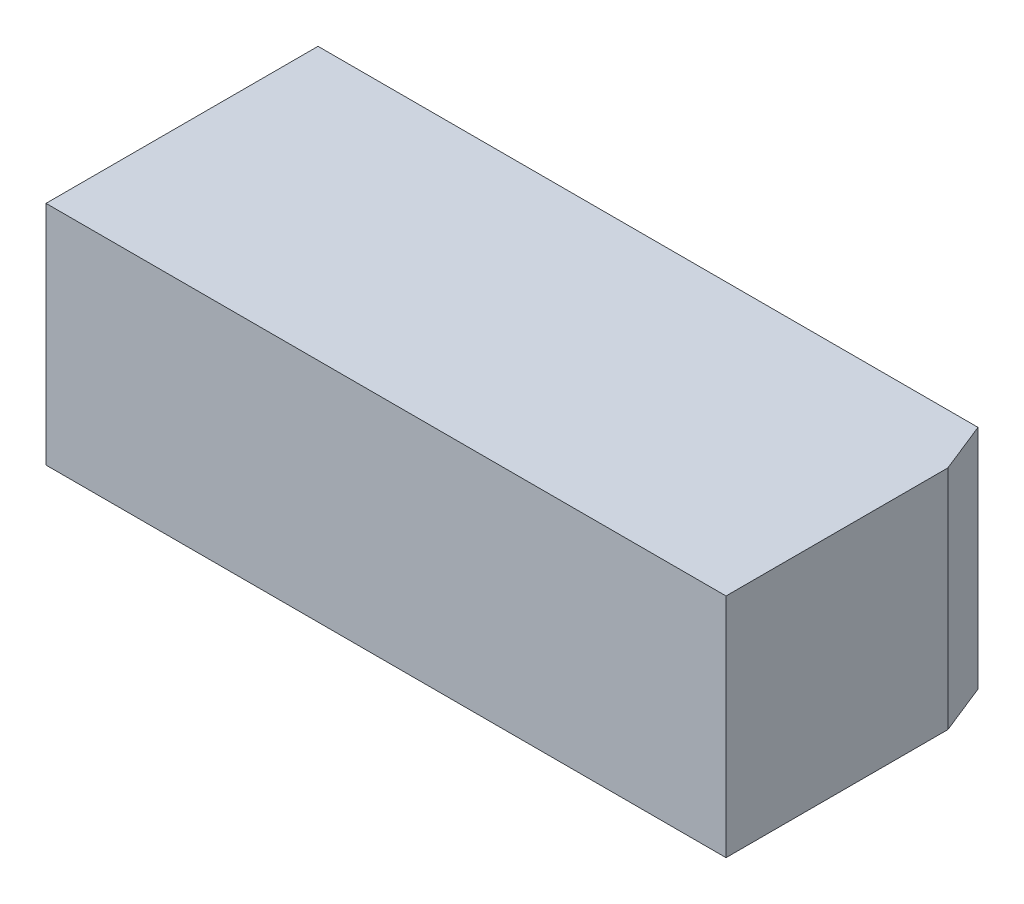
ISO-10303-21;
HEADER;
FILE_DESCRIPTION(('STEP AP214'),'2;1');
FILE_NAME('part.step','',(''),(''),'','','');
FILE_SCHEMA(('AUTOMOTIVE_DESIGN { 1 0 10303 214 1 1 1 1 }'));
ENDSEC;
DATA;
#1=APPLICATION_CONTEXT('core data for automotive mechanical design processes');
#2=APPLICATION_PROTOCOL_DEFINITION('international standard','automotive_design',2000,#1);
#3=PRODUCT_CONTEXT('',#1,'mechanical');
#4=PRODUCT('Part','Part','',(#3));
#5=PRODUCT_RELATED_PRODUCT_CATEGORY('part','',(#4));
#6=PRODUCT_DEFINITION_FORMATION('','',#4);
#7=PRODUCT_DEFINITION_CONTEXT('part definition',#1,'design');
#8=PRODUCT_DEFINITION('design','',#6,#7);
#9=PRODUCT_DEFINITION_SHAPE('','',#8);
#10=(LENGTH_UNIT() NAMED_UNIT(*) SI_UNIT(.MILLI.,.METRE.));
#11=(NAMED_UNIT(*) PLANE_ANGLE_UNIT() SI_UNIT($,.RADIAN.));
#12=(NAMED_UNIT(*) SI_UNIT($,.STERADIAN.) SOLID_ANGLE_UNIT());
#13=UNCERTAINTY_MEASURE_WITH_UNIT(LENGTH_MEASURE(1.E-05),#10,'distance_accuracy_value','');
#14=(GEOMETRIC_REPRESENTATION_CONTEXT(3) GLOBAL_UNCERTAINTY_ASSIGNED_CONTEXT((#13)) GLOBAL_UNIT_ASSIGNED_CONTEXT((#10,
#11,#12)) REPRESENTATION_CONTEXT('',''));
#15=CARTESIAN_POINT('',(0.,0.,0.));
#16=DIRECTION('',(0.,0.,1.));
#17=DIRECTION('',(1.,0.,0.));
#18=AXIS2_PLACEMENT_3D('',#15,#16,#17);
#19=CARTESIAN_POINT('',(-7.5,5.,-3.));
#20=DIRECTION('',(1.,0.,0.));
#21=DIRECTION('',(0.,0.,-1.));
#22=AXIS2_PLACEMENT_3D('',#19,#20,#21);
#23=PLANE('',#22);
#24=DIRECTION('',(0.,0.,1.));
#25=VECTOR('',#24,1.);
#26=CARTESIAN_POINT('',(-7.5,0.,-3.));
#27=LINE('',#26,#25);
#28=CARTESIAN_POINT('',(-7.5,0.,-3.));
#29=VERTEX_POINT('',#28);
#30=CARTESIAN_POINT('',(-7.5,0.,3.));
#31=VERTEX_POINT('',#30);
#32=EDGE_CURVE('E109',#29,#31,#27,.T.);
#33=ORIENTED_EDGE('',*,*,#32,.T.);
#34=DIRECTION('',(0.,-1.,0.));
#35=VECTOR('',#34,1.);
#36=CARTESIAN_POINT('',(-7.5,5.,3.));
#37=LINE('',#36,#35);
#38=CARTESIAN_POINT('',(-7.5,5.,3.));
#39=VERTEX_POINT('',#38);
#40=EDGE_CURVE('E11',#39,#31,#37,.T.);
#41=ORIENTED_EDGE('',*,*,#40,.F.);
#42=DIRECTION('',(0.,0.,1.));
#43=VECTOR('',#42,1.);
#44=CARTESIAN_POINT('',(-7.5,5.,-3.));
#45=LINE('',#44,#43);
#46=CARTESIAN_POINT('',(-7.5,5.,-3.));
#47=VERTEX_POINT('',#46);
#48=EDGE_CURVE('E105',#47,#39,#45,.T.);
#49=ORIENTED_EDGE('',*,*,#48,.F.);
#50=DIRECTION('',(0.,-1.,0.));
#51=VECTOR('',#50,1.);
#52=CARTESIAN_POINT('',(-7.5,5.,-3.));
#53=LINE('',#52,#51);
#54=EDGE_CURVE('E103',#47,#29,#53,.T.);
#55=ORIENTED_EDGE('',*,*,#54,.T.);
#56=EDGE_LOOP('',(#33,#41,#49,#55));
#57=FACE_BOUND('',#56,.T.);
#58=ADVANCED_FACE('F33',(#57),#23,.F.);
#59=CARTESIAN_POINT('',(7.5,5.,3.));
#60=DIRECTION('',(0.,0.,-1.));
#61=DIRECTION('',(-1.,0.,0.));
#62=AXIS2_PLACEMENT_3D('',#59,#60,#61);
#63=PLANE('',#62);
#64=DIRECTION('',(1.,0.,0.));
#65=VECTOR('',#64,1.);
#66=CARTESIAN_POINT('',(7.5,0.,3.));
#67=LINE('',#66,#65);
#68=CARTESIAN_POINT('',(7.5,0.,3.));
#69=VERTEX_POINT('',#68);
#70=EDGE_CURVE('E112',#31,#69,#67,.T.);
#71=ORIENTED_EDGE('',*,*,#70,.T.);
#72=DIRECTION('',(0.,-1.,0.));
#73=VECTOR('',#72,1.);
#74=CARTESIAN_POINT('',(7.5,5.,3.));
#75=LINE('',#74,#73);
#76=CARTESIAN_POINT('',(7.5,5.,3.));
#77=VERTEX_POINT('',#76);
#78=EDGE_CURVE('E40',#77,#69,#75,.T.);
#79=ORIENTED_EDGE('',*,*,#78,.F.);
#80=DIRECTION('',(1.,0.,0.));
#81=VECTOR('',#80,1.);
#82=CARTESIAN_POINT('',(7.5,5.,3.));
#83=LINE('',#82,#81);
#84=EDGE_CURVE('E79',#39,#77,#83,.T.);
#85=ORIENTED_EDGE('',*,*,#84,.F.);
#86=ORIENTED_EDGE('',*,*,#40,.T.);
#87=EDGE_LOOP('',(#71,#79,#85,#86));
#88=FACE_BOUND('',#87,.T.);
#89=ADVANCED_FACE('F154',(#88),#63,.F.);
#90=CARTESIAN_POINT('',(7.5,5.,-3.));
#91=DIRECTION('',(-1.,0.,0.));
#92=DIRECTION('',(0.,0.,1.));
#93=AXIS2_PLACEMENT_3D('',#90,#91,#92);
#94=PLANE('',#93);
#95=DIRECTION('',(0.,0.,-1.));
#96=VECTOR('',#95,1.);
#97=CARTESIAN_POINT('',(7.5,0.,-3.));
#98=LINE('',#97,#96);
#99=CARTESIAN_POINT('',(7.5,0.,-1.89511273784654));
#100=VERTEX_POINT('',#99);
#101=EDGE_CURVE('E99',#69,#100,#98,.T.);
#102=ORIENTED_EDGE('',*,*,#101,.T.);
#103=DIRECTION('',(0.,-1.,0.));
#104=VECTOR('',#103,1.);
#105=CARTESIAN_POINT('',(7.5,5.,-1.89511273784654));
#106=LINE('',#105,#104);
#107=CARTESIAN_POINT('',(7.5,5.,-1.89511273784654));
#108=VERTEX_POINT('',#107);
#109=EDGE_CURVE('E47',#108,#100,#106,.T.);
#110=ORIENTED_EDGE('',*,*,#109,.F.);
#111=DIRECTION('',(0.,0.,-1.));
#112=VECTOR('',#111,1.);
#113=CARTESIAN_POINT('',(7.5,5.,-3.));
#114=LINE('',#113,#112);
#115=EDGE_CURVE('E97',#77,#108,#114,.T.);
#116=ORIENTED_EDGE('',*,*,#115,.F.);
#117=ORIENTED_EDGE('',*,*,#78,.T.);
#118=EDGE_LOOP('',(#102,#110,#116,#117));
#119=FACE_BOUND('',#118,.T.);
#120=ADVANCED_FACE('F95',(#119),#94,.F.);
#121=CARTESIAN_POINT('',(7.5,5.,-3.));
#122=DIRECTION('',(0.,0.,1.));
#123=DIRECTION('',(1.,0.,0.));
#124=AXIS2_PLACEMENT_3D('',#121,#122,#123);
#125=PLANE('',#124);
#126=DIRECTION('',(-1.,0.,0.));
#127=VECTOR('',#126,1.);
#128=CARTESIAN_POINT('',(7.5,5.,-3.));
#129=LINE('',#128,#127);
#130=CARTESIAN_POINT('',(7.05804509513862,5.,-3.));
#131=VERTEX_POINT('',#130);
#132=EDGE_CURVE('E56',#131,#47,#129,.T.);
#133=ORIENTED_EDGE('',*,*,#132,.F.);
#134=DIRECTION('',(0.,-1.,0.));
#135=VECTOR('',#134,1.);
#136=CARTESIAN_POINT('',(7.05804509513862,5.,-3.));
#137=LINE('',#136,#135);
#138=CARTESIAN_POINT('',(7.05804509513862,0.,-3.));
#139=VERTEX_POINT('',#138);
#140=EDGE_CURVE('E88',#131,#139,#137,.T.);
#141=ORIENTED_EDGE('',*,*,#140,.T.);
#142=DIRECTION('',(-1.,0.,0.));
#143=VECTOR('',#142,1.);
#144=CARTESIAN_POINT('',(7.5,0.,-3.));
#145=LINE('',#144,#143);
#146=EDGE_CURVE('E74',#139,#29,#145,.T.);
#147=ORIENTED_EDGE('',*,*,#146,.T.);
#148=ORIENTED_EDGE('',*,*,#54,.F.);
#149=EDGE_LOOP('',(#133,#141,#147,#148));
#150=FACE_BOUND('',#149,.T.);
#151=ADVANCED_FACE('F160',(#150),#125,.F.);
#152=CARTESIAN_POINT('',(0.,5.,0.));
#153=DIRECTION('',(0.,-1.,0.));
#154=DIRECTION('',(0.,0.,-1.));
#155=AXIS2_PLACEMENT_3D('',#152,#153,#154);
#156=PLANE('',#155);
#157=ORIENTED_EDGE('',*,*,#115,.T.);
#158=DIRECTION('',(-0.371390676354104,0.,-0.928476690885259));
#159=VECTOR('',#158,1.);
#160=CARTESIAN_POINT('',(7.05804509513862,5.,-3.));
#161=LINE('',#160,#159);
#162=EDGE_CURVE('E86',#108,#131,#161,.T.);
#163=ORIENTED_EDGE('',*,*,#162,.T.);
#164=ORIENTED_EDGE('',*,*,#132,.T.);
#165=ORIENTED_EDGE('',*,*,#48,.T.);
#166=ORIENTED_EDGE('',*,*,#84,.T.);
#167=EDGE_LOOP('',(#157,#163,#164,#165,#166));
#168=FACE_BOUND('',#167,.T.);
#169=ADVANCED_FACE('F101',(#168),#156,.F.);
#170=CARTESIAN_POINT('',(0.,0.,0.));
#171=DIRECTION('',(0.,-1.,0.));
#172=DIRECTION('',(0.,0.,-1.));
#173=AXIS2_PLACEMENT_3D('',#170,#171,#172);
#174=PLANE('',#173);
#175=CARTESIAN_POINT('',(-2.,0.,-2.));
#176=DIRECTION('',(0.,-1.,0.));
#177=DIRECTION('',(0.,0.,-1.));
#178=AXIS2_PLACEMENT_3D('',#175,#176,#177);
#179=CIRCLE('',#178,0.5);
#180=CARTESIAN_POINT('',(-2.,0.,-2.5));
#181=VERTEX_POINT('',#180);
#182=EDGE_CURVE('E124',#181,#181,#179,.T.);
#183=ORIENTED_EDGE('',*,*,#182,.F.);
#184=EDGE_LOOP('',(#183));
#185=FACE_BOUND('',#184,.T.);
#186=DIRECTION('',(-0.371390676354104,0.,-0.928476690885259));
#187=VECTOR('',#186,1.);
#188=CARTESIAN_POINT('',(7.05804509513862,0.,-3.));
#189=LINE('',#188,#187);
#190=EDGE_CURVE('E90',#100,#139,#189,.T.);
#191=ORIENTED_EDGE('',*,*,#190,.F.);
#192=ORIENTED_EDGE('',*,*,#101,.F.);
#193=ORIENTED_EDGE('',*,*,#70,.F.);
#194=ORIENTED_EDGE('',*,*,#32,.F.);
#195=ORIENTED_EDGE('',*,*,#146,.F.);
#196=EDGE_LOOP('',(#191,#192,#193,#194,#195));
#197=FACE_BOUND('',#196,.T.);
#198=CARTESIAN_POINT('',(-1.5,0.,0.));
#199=DIRECTION('',(0.,-1.,0.));
#200=DIRECTION('',(0.,0.,-1.));
#201=AXIS2_PLACEMENT_3D('',#198,#199,#200);
#202=CIRCLE('',#201,0.795000000000002);
#203=CARTESIAN_POINT('',(-1.5,0.,-0.795000000000002));
#204=VERTEX_POINT('',#203);
#205=EDGE_CURVE('E128',#204,#204,#202,.T.);
#206=ORIENTED_EDGE('',*,*,#205,.F.);
#207=EDGE_LOOP('',(#206));
#208=FACE_BOUND('',#207,.T.);
#209=CARTESIAN_POINT('',(-6.25,0.,1.875));
#210=DIRECTION('',(0.,-1.,0.));
#211=DIRECTION('',(0.,0.,-1.));
#212=AXIS2_PLACEMENT_3D('',#209,#210,#211);
#213=CIRCLE('',#212,0.795000000000002);
#214=CARTESIAN_POINT('',(-6.25,0.,1.08));
#215=VERTEX_POINT('',#214);
#216=EDGE_CURVE('E133',#215,#215,#213,.T.);
#217=ORIENTED_EDGE('',*,*,#216,.F.);
#218=EDGE_LOOP('',(#217));
#219=FACE_BOUND('',#218,.T.);
#220=CARTESIAN_POINT('',(-6.25,0.,-1.875));
#221=DIRECTION('',(0.,-1.,0.));
#222=DIRECTION('',(0.,0.,-1.));
#223=AXIS2_PLACEMENT_3D('',#220,#221,#222);
#224=CIRCLE('',#223,0.795000000000001);
#225=CARTESIAN_POINT('',(-6.25,0.,-2.67));
#226=VERTEX_POINT('',#225);
#227=EDGE_CURVE('E139',#226,#226,#224,.T.);
#228=ORIENTED_EDGE('',*,*,#227,.F.);
#229=EDGE_LOOP('',(#228));
#230=FACE_BOUND('',#229,.T.);
#231=CARTESIAN_POINT('',(-4.5,0.,0.));
#232=DIRECTION('',(0.,-1.,0.));
#233=DIRECTION('',(0.,0.,-1.));
#234=AXIS2_PLACEMENT_3D('',#231,#232,#233);
#235=CIRCLE('',#234,1.25);
#236=CARTESIAN_POINT('',(-4.5,0.,-1.25));
#237=VERTEX_POINT('',#236);
#238=EDGE_CURVE('E145',#237,#237,#235,.T.);
#239=ORIENTED_EDGE('',*,*,#238,.F.);
#240=EDGE_LOOP('',(#239));
#241=FACE_BOUND('',#240,.T.);
#242=ADVANCED_FACE('F118',(#185,#197,#208,#219,#230,#241),#174,.T.);
#243=CARTESIAN_POINT('',(-4.5,4.,0.));
#244=DIRECTION('',(0.,-1.,0.));
#245=DIRECTION('',(0.,0.,-1.));
#246=AXIS2_PLACEMENT_3D('',#243,#244,#245);
#247=CYLINDRICAL_SURFACE('',#246,1.25);
#248=CARTESIAN_POINT('',(-4.5,4.,0.));
#249=DIRECTION('',(0.,-1.,0.));
#250=DIRECTION('',(0.,0.,-1.));
#251=AXIS2_PLACEMENT_3D('',#248,#249,#250);
#252=CIRCLE('',#251,1.25);
#253=CARTESIAN_POINT('',(-4.5,4.,-1.25));
#254=VERTEX_POINT('',#253);
#255=EDGE_CURVE('E113',#254,#254,#252,.T.);
#256=ORIENTED_EDGE('',*,*,#255,.F.);
#257=EDGE_LOOP('',(#256));
#258=FACE_BOUND('',#257,.T.);
#259=ORIENTED_EDGE('',*,*,#238,.T.);
#260=EDGE_LOOP('',(#259));
#261=FACE_BOUND('',#260,.T.);
#262=ADVANCED_FACE('F167',(#258,#261),#247,.F.);
#263=CARTESIAN_POINT('',(-4.5,4.,0.));
#264=DIRECTION('',(0.,-1.,0.));
#265=DIRECTION('',(0.,0.,-1.));
#266=AXIS2_PLACEMENT_3D('',#263,#264,#265);
#267=PLANE('',#266);
#268=ORIENTED_EDGE('',*,*,#255,.T.);
#269=EDGE_LOOP('',(#268));
#270=FACE_BOUND('',#269,.T.);
#271=ADVANCED_FACE('F173',(#270),#267,.T.);
#272=CARTESIAN_POINT('',(-6.25,1.,-1.875));
#273=DIRECTION('',(0.,-1.,0.));
#274=DIRECTION('',(0.,0.,-1.));
#275=AXIS2_PLACEMENT_3D('',#272,#273,#274);
#276=CYLINDRICAL_SURFACE('',#275,0.795000000000001);
#277=CARTESIAN_POINT('',(-6.25,1.,-1.875));
#278=DIRECTION('',(0.,-1.,0.));
#279=DIRECTION('',(0.,0.,-1.));
#280=AXIS2_PLACEMENT_3D('',#277,#278,#279);
#281=CIRCLE('',#280,0.795000000000001);
#282=CARTESIAN_POINT('',(-6.25,1.,-2.67));
#283=VERTEX_POINT('',#282);
#284=EDGE_CURVE('E142',#283,#283,#281,.T.);
#285=ORIENTED_EDGE('',*,*,#284,.F.);
#286=EDGE_LOOP('',(#285));
#287=FACE_BOUND('',#286,.T.);
#288=ORIENTED_EDGE('',*,*,#227,.T.);
#289=EDGE_LOOP('',(#288));
#290=FACE_BOUND('',#289,.T.);
#291=ADVANCED_FACE('F177',(#287,#290),#276,.F.);
#292=CARTESIAN_POINT('',(-6.25,1.,-1.875));
#293=DIRECTION('',(0.,-1.,0.));
#294=DIRECTION('',(0.,0.,-1.));
#295=AXIS2_PLACEMENT_3D('',#292,#293,#294);
#296=PLANE('',#295);
#297=ORIENTED_EDGE('',*,*,#284,.T.);
#298=EDGE_LOOP('',(#297));
#299=FACE_BOUND('',#298,.T.);
#300=ADVANCED_FACE('F181',(#299),#296,.T.);
#301=CARTESIAN_POINT('',(-6.25,1.,1.875));
#302=DIRECTION('',(0.,-1.,0.));
#303=DIRECTION('',(0.,0.,-1.));
#304=AXIS2_PLACEMENT_3D('',#301,#302,#303);
#305=CYLINDRICAL_SURFACE('',#304,0.795000000000002);
#306=CARTESIAN_POINT('',(-6.25,1.,1.875));
#307=DIRECTION('',(0.,-1.,0.));
#308=DIRECTION('',(0.,0.,-1.));
#309=AXIS2_PLACEMENT_3D('',#306,#307,#308);
#310=CIRCLE('',#309,0.795000000000002);
#311=CARTESIAN_POINT('',(-6.25,1.,1.08));
#312=VERTEX_POINT('',#311);
#313=EDGE_CURVE('E136',#312,#312,#310,.T.);
#314=ORIENTED_EDGE('',*,*,#313,.F.);
#315=EDGE_LOOP('',(#314));
#316=FACE_BOUND('',#315,.T.);
#317=ORIENTED_EDGE('',*,*,#216,.T.);
#318=EDGE_LOOP('',(#317));
#319=FACE_BOUND('',#318,.T.);
#320=ADVANCED_FACE('F185',(#316,#319),#305,.F.);
#321=CARTESIAN_POINT('',(-6.25,1.,1.875));
#322=DIRECTION('',(0.,-1.,0.));
#323=DIRECTION('',(0.,0.,-1.));
#324=AXIS2_PLACEMENT_3D('',#321,#322,#323);
#325=PLANE('',#324);
#326=ORIENTED_EDGE('',*,*,#313,.T.);
#327=EDGE_LOOP('',(#326));
#328=FACE_BOUND('',#327,.T.);
#329=ADVANCED_FACE('F189',(#328),#325,.T.);
#330=CARTESIAN_POINT('',(-1.5,1.,0.));
#331=DIRECTION('',(0.,-1.,0.));
#332=DIRECTION('',(0.,0.,-1.));
#333=AXIS2_PLACEMENT_3D('',#330,#331,#332);
#334=CYLINDRICAL_SURFACE('',#333,0.795000000000002);
#335=CARTESIAN_POINT('',(-1.5,1.,0.));
#336=DIRECTION('',(0.,-1.,0.));
#337=DIRECTION('',(0.,0.,-1.));
#338=AXIS2_PLACEMENT_3D('',#335,#336,#337);
#339=CIRCLE('',#338,0.795000000000002);
#340=CARTESIAN_POINT('',(-1.5,1.,-0.795000000000002));
#341=VERTEX_POINT('',#340);
#342=EDGE_CURVE('E130',#341,#341,#339,.T.);
#343=ORIENTED_EDGE('',*,*,#342,.F.);
#344=EDGE_LOOP('',(#343));
#345=FACE_BOUND('',#344,.T.);
#346=ORIENTED_EDGE('',*,*,#205,.T.);
#347=EDGE_LOOP('',(#346));
#348=FACE_BOUND('',#347,.T.);
#349=ADVANCED_FACE('F193',(#345,#348),#334,.F.);
#350=CARTESIAN_POINT('',(-1.5,1.,0.));
#351=DIRECTION('',(0.,-1.,0.));
#352=DIRECTION('',(0.,0.,-1.));
#353=AXIS2_PLACEMENT_3D('',#350,#351,#352);
#354=PLANE('',#353);
#355=ORIENTED_EDGE('',*,*,#342,.T.);
#356=EDGE_LOOP('',(#355));
#357=FACE_BOUND('',#356,.T.);
#358=ADVANCED_FACE('F197',(#357),#354,.T.);
#359=CARTESIAN_POINT('',(7.05804509513862,5.,-3.));
#360=DIRECTION('',(-0.928476690885259,0.,0.371390676354104));
#361=DIRECTION('',(0.371390676354104,0.,0.928476690885259));
#362=AXIS2_PLACEMENT_3D('',#359,#360,#361);
#363=PLANE('',#362);
#364=ORIENTED_EDGE('',*,*,#190,.T.);
#365=ORIENTED_EDGE('',*,*,#140,.F.);
#366=ORIENTED_EDGE('',*,*,#162,.F.);
#367=ORIENTED_EDGE('',*,*,#109,.T.);
#368=EDGE_LOOP('',(#364,#365,#366,#367));
#369=FACE_BOUND('',#368,.T.);
#370=ADVANCED_FACE('F87',(#369),#363,.F.);
#371=CARTESIAN_POINT('',(-2.,2.,-2.));
#372=DIRECTION('',(0.,-1.,0.));
#373=DIRECTION('',(0.,0.,-1.));
#374=AXIS2_PLACEMENT_3D('',#371,#372,#373);
#375=CYLINDRICAL_SURFACE('',#374,0.5);
#376=CARTESIAN_POINT('',(-2.,2.,-2.));
#377=DIRECTION('',(0.,-1.,0.));
#378=DIRECTION('',(0.,0.,-1.));
#379=AXIS2_PLACEMENT_3D('',#376,#377,#378);
#380=CIRCLE('',#379,0.5);
#381=CARTESIAN_POINT('',(-2.,2.,-2.5));
#382=VERTEX_POINT('',#381);
#383=EDGE_CURVE('E121',#382,#382,#380,.T.);
#384=ORIENTED_EDGE('',*,*,#383,.F.);
#385=EDGE_LOOP('',(#384));
#386=FACE_BOUND('',#385,.T.);
#387=ORIENTED_EDGE('',*,*,#182,.T.);
#388=EDGE_LOOP('',(#387));
#389=FACE_BOUND('',#388,.T.);
#390=ADVANCED_FACE('F204',(#386,#389),#375,.F.);
#391=CARTESIAN_POINT('',(-2.,2.,-2.));
#392=DIRECTION('',(0.,-1.,0.));
#393=DIRECTION('',(0.,0.,-1.));
#394=AXIS2_PLACEMENT_3D('',#391,#392,#393);
#395=PLANE('',#394);
#396=ORIENTED_EDGE('',*,*,#383,.T.);
#397=EDGE_LOOP('',(#396));
#398=FACE_BOUND('',#397,.T.);
#399=ADVANCED_FACE('F207',(#398),#395,.T.);
#400=CLOSED_SHELL('',(#58,#89,#120,#151,#169,#242,#262,#271,#291,#300,#320,#329,#349,#358,#370,
#390,#399));
#401=MANIFOLD_SOLID_BREP('B2',#400);
#402=ADVANCED_BREP_SHAPE_REPRESENTATION('',(#18,#401),#14);
#403=SHAPE_DEFINITION_REPRESENTATION(#9,#402);
ENDSEC;
END-ISO-10303-21;
